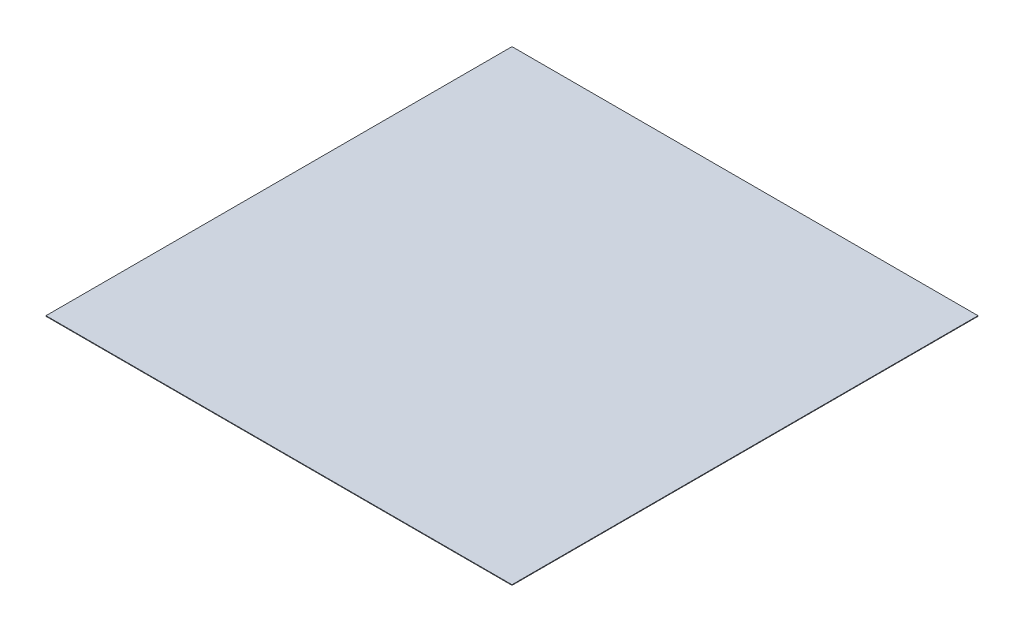
ISO-10303-21;
HEADER;
FILE_DESCRIPTION(('STEP AP214'),'2;1');
FILE_NAME('part.step','',(''),(''),'','','');
FILE_SCHEMA(('AUTOMOTIVE_DESIGN { 1 0 10303 214 1 1 1 1 }'));
ENDSEC;
DATA;
#1=APPLICATION_CONTEXT('core data for automotive mechanical design processes');
#2=APPLICATION_PROTOCOL_DEFINITION('international standard','automotive_design',2000,#1);
#3=PRODUCT_CONTEXT('',#1,'mechanical');
#4=PRODUCT('Part','Part','',(#3));
#5=PRODUCT_RELATED_PRODUCT_CATEGORY('part','',(#4));
#6=PRODUCT_DEFINITION_FORMATION('','',#4);
#7=PRODUCT_DEFINITION_CONTEXT('part definition',#1,'design');
#8=PRODUCT_DEFINITION('design','',#6,#7);
#9=PRODUCT_DEFINITION_SHAPE('','',#8);
#10=(LENGTH_UNIT() NAMED_UNIT(*) SI_UNIT(.MILLI.,.METRE.));
#11=(NAMED_UNIT(*) PLANE_ANGLE_UNIT() SI_UNIT($,.RADIAN.));
#12=(NAMED_UNIT(*) SI_UNIT($,.STERADIAN.) SOLID_ANGLE_UNIT());
#13=UNCERTAINTY_MEASURE_WITH_UNIT(LENGTH_MEASURE(1.E-05),#10,'distance_accuracy_value','');
#14=(GEOMETRIC_REPRESENTATION_CONTEXT(3) GLOBAL_UNCERTAINTY_ASSIGNED_CONTEXT((#13)) GLOBAL_UNIT_ASSIGNED_CONTEXT((#10,
#11,#12)) REPRESENTATION_CONTEXT('',''));
#15=CARTESIAN_POINT('',(0.,0.,0.));
#16=DIRECTION('',(0.,0.,1.));
#17=DIRECTION('',(1.,0.,0.));
#18=AXIS2_PLACEMENT_3D('',#15,#16,#17);
#19=CARTESIAN_POINT('',(-391.413987302697,1.,-371.517027863777));
#20=DIRECTION('',(1.,0.,0.));
#21=DIRECTION('',(0.,0.,-1.));
#22=AXIS2_PLACEMENT_3D('',#19,#20,#21);
#23=PLANE('',#22);
#24=DIRECTION('',(0.,0.,1.));
#25=VECTOR('',#24,1.);
#26=CARTESIAN_POINT('',(-391.413987302697,0.,-371.517027863777));
#27=LINE('',#26,#25);
#28=CARTESIAN_POINT('',(-391.413987302697,0.,-371.517027863777));
#29=VERTEX_POINT('',#28);
#30=CARTESIAN_POINT('',(-391.413987302697,0.,428.482972136223));
#31=VERTEX_POINT('',#30);
#32=EDGE_CURVE('E105',#29,#31,#27,.T.);
#33=ORIENTED_EDGE('',*,*,#32,.T.);
#34=DIRECTION('',(0.,-1.,0.));
#35=VECTOR('',#34,1.);
#36=CARTESIAN_POINT('',(-391.413987302697,1.,428.482972136223));
#37=LINE('',#36,#35);
#38=CARTESIAN_POINT('',(-391.413987302697,1.,428.482972136223));
#39=VERTEX_POINT('',#38);
#40=EDGE_CURVE('E11',#39,#31,#37,.T.);
#41=ORIENTED_EDGE('',*,*,#40,.F.);
#42=DIRECTION('',(0.,0.,1.));
#43=VECTOR('',#42,1.);
#44=CARTESIAN_POINT('',(-391.413987302697,1.,-371.517027863777));
#45=LINE('',#44,#43);
#46=CARTESIAN_POINT('',(-391.413987302697,1.,-371.517027863777));
#47=VERTEX_POINT('',#46);
#48=EDGE_CURVE('E89',#47,#39,#45,.T.);
#49=ORIENTED_EDGE('',*,*,#48,.F.);
#50=DIRECTION('',(0.,-1.,0.));
#51=VECTOR('',#50,1.);
#52=CARTESIAN_POINT('',(-391.413987302697,1.,-371.517027863777));
#53=LINE('',#52,#51);
#54=EDGE_CURVE('E97',#47,#29,#53,.T.);
#55=ORIENTED_EDGE('',*,*,#54,.T.);
#56=EDGE_LOOP('',(#33,#41,#49,#55));
#57=FACE_BOUND('',#56,.T.);
#58=ADVANCED_FACE('F39',(#57),#23,.F.);
#59=CARTESIAN_POINT('',(-391.413987302697,1.,428.482972136223));
#60=DIRECTION('',(0.,0.,-1.));
#61=DIRECTION('',(-1.,0.,0.));
#62=AXIS2_PLACEMENT_3D('',#59,#60,#61);
#63=PLANE('',#62);
#64=DIRECTION('',(1.,0.,0.));
#65=VECTOR('',#64,1.);
#66=CARTESIAN_POINT('',(-391.413987302697,0.,428.482972136223));
#67=LINE('',#66,#65);
#68=CARTESIAN_POINT('',(408.586012697303,0.,428.482972136223));
#69=VERTEX_POINT('',#68);
#70=EDGE_CURVE('E92',#31,#69,#67,.T.);
#71=ORIENTED_EDGE('',*,*,#70,.T.);
#72=DIRECTION('',(0.,-1.,0.));
#73=VECTOR('',#72,1.);
#74=CARTESIAN_POINT('',(408.586012697303,1.,428.482972136223));
#75=LINE('',#74,#73);
#76=CARTESIAN_POINT('',(408.586012697303,1.,428.482972136223));
#77=VERTEX_POINT('',#76);
#78=EDGE_CURVE('E50',#77,#69,#75,.T.);
#79=ORIENTED_EDGE('',*,*,#78,.F.);
#80=DIRECTION('',(1.,0.,0.));
#81=VECTOR('',#80,1.);
#82=CARTESIAN_POINT('',(-391.413987302697,1.,428.482972136223));
#83=LINE('',#82,#81);
#84=EDGE_CURVE('E82',#39,#77,#83,.T.);
#85=ORIENTED_EDGE('',*,*,#84,.F.);
#86=ORIENTED_EDGE('',*,*,#40,.T.);
#87=EDGE_LOOP('',(#71,#79,#85,#86));
#88=FACE_BOUND('',#87,.T.);
#89=ADVANCED_FACE('F93',(#88),#63,.F.);
#90=CARTESIAN_POINT('',(408.586012697303,1.,-371.517027863777));
#91=DIRECTION('',(-1.,0.,0.));
#92=DIRECTION('',(0.,0.,1.));
#93=AXIS2_PLACEMENT_3D('',#90,#91,#92);
#94=PLANE('',#93);
#95=DIRECTION('',(0.,0.,-1.));
#96=VECTOR('',#95,1.);
#97=CARTESIAN_POINT('',(408.586012697303,0.,-371.517027863777));
#98=LINE('',#97,#96);
#99=CARTESIAN_POINT('',(408.586012697303,0.,-371.517027863777));
#100=VERTEX_POINT('',#99);
#101=EDGE_CURVE('E72',#69,#100,#98,.T.);
#102=ORIENTED_EDGE('',*,*,#101,.T.);
#103=DIRECTION('',(0.,-1.,0.));
#104=VECTOR('',#103,1.);
#105=CARTESIAN_POINT('',(408.586012697303,1.,-371.517027863777));
#106=LINE('',#105,#104);
#107=CARTESIAN_POINT('',(408.586012697303,1.,-371.517027863777));
#108=VERTEX_POINT('',#107);
#109=EDGE_CURVE('E94',#108,#100,#106,.T.);
#110=ORIENTED_EDGE('',*,*,#109,.F.);
#111=DIRECTION('',(0.,0.,-1.));
#112=VECTOR('',#111,1.);
#113=CARTESIAN_POINT('',(408.586012697303,1.,-371.517027863777));
#114=LINE('',#113,#112);
#115=EDGE_CURVE('E88',#77,#108,#114,.T.);
#116=ORIENTED_EDGE('',*,*,#115,.F.);
#117=ORIENTED_EDGE('',*,*,#78,.T.);
#118=EDGE_LOOP('',(#102,#110,#116,#117));
#119=FACE_BOUND('',#118,.T.);
#120=ADVANCED_FACE('F96',(#119),#94,.F.);
#121=CARTESIAN_POINT('',(-391.413987302697,1.,-371.517027863777));
#122=DIRECTION('',(0.,0.,1.));
#123=DIRECTION('',(1.,0.,0.));
#124=AXIS2_PLACEMENT_3D('',#121,#122,#123);
#125=PLANE('',#124);
#126=DIRECTION('',(-1.,0.,0.));
#127=VECTOR('',#126,1.);
#128=CARTESIAN_POINT('',(-391.413987302697,0.,-371.517027863777));
#129=LINE('',#128,#127);
#130=EDGE_CURVE('E76',#100,#29,#129,.T.);
#131=ORIENTED_EDGE('',*,*,#130,.T.);
#132=ORIENTED_EDGE('',*,*,#54,.F.);
#133=DIRECTION('',(-1.,0.,0.));
#134=VECTOR('',#133,1.);
#135=CARTESIAN_POINT('',(-391.413987302697,1.,-371.517027863777));
#136=LINE('',#135,#134);
#137=EDGE_CURVE('E54',#108,#47,#136,.T.);
#138=ORIENTED_EDGE('',*,*,#137,.F.);
#139=ORIENTED_EDGE('',*,*,#109,.T.);
#140=EDGE_LOOP('',(#131,#132,#138,#139));
#141=FACE_BOUND('',#140,.T.);
#142=ADVANCED_FACE('F108',(#141),#125,.F.);
#143=CARTESIAN_POINT('',(0.,1.,0.));
#144=DIRECTION('',(0.,1.,0.));
#145=DIRECTION('',(0.,0.,1.));
#146=AXIS2_PLACEMENT_3D('',#143,#144,#145);
#147=PLANE('',#146);
#148=ORIENTED_EDGE('',*,*,#48,.T.);
#149=ORIENTED_EDGE('',*,*,#84,.T.);
#150=ORIENTED_EDGE('',*,*,#115,.T.);
#151=ORIENTED_EDGE('',*,*,#137,.T.);
#152=EDGE_LOOP('',(#148,#149,#150,#151));
#153=FACE_BOUND('',#152,.T.);
#154=ADVANCED_FACE('F86',(#153),#147,.T.);
#155=CARTESIAN_POINT('',(0.,0.,0.));
#156=DIRECTION('',(0.,1.,0.));
#157=DIRECTION('',(0.,0.,1.));
#158=AXIS2_PLACEMENT_3D('',#155,#156,#157);
#159=PLANE('',#158);
#160=ORIENTED_EDGE('',*,*,#32,.F.);
#161=ORIENTED_EDGE('',*,*,#130,.F.);
#162=ORIENTED_EDGE('',*,*,#101,.F.);
#163=ORIENTED_EDGE('',*,*,#70,.F.);
#164=EDGE_LOOP('',(#160,#161,#162,#163));
#165=FACE_BOUND('',#164,.T.);
#166=ADVANCED_FACE('F115',(#165),#159,.F.);
#167=CLOSED_SHELL('',(#58,#89,#120,#142,#154,#166));
#168=MANIFOLD_SOLID_BREP('B2',#167);
#169=ADVANCED_BREP_SHAPE_REPRESENTATION('',(#18,#168),#14);
#170=SHAPE_DEFINITION_REPRESENTATION(#9,#169);
ENDSEC;
END-ISO-10303-21;
